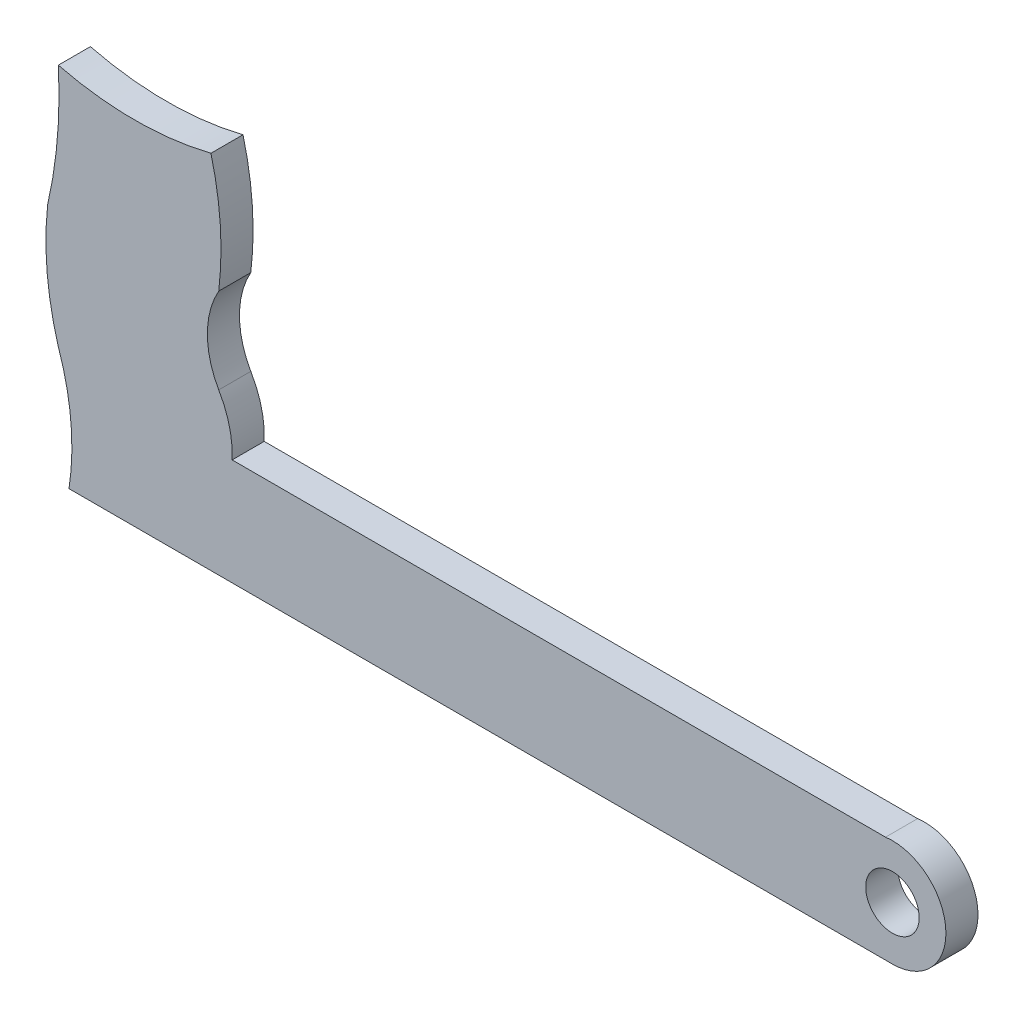
ISO-10303-21;
HEADER;
FILE_DESCRIPTION(('STEP AP214'),'2;1');
FILE_NAME('part.step','',(''),(''),'','','');
FILE_SCHEMA(('AUTOMOTIVE_DESIGN { 1 0 10303 214 1 1 1 1 }'));
ENDSEC;
DATA;
#1=APPLICATION_CONTEXT('core data for automotive mechanical design processes');
#2=APPLICATION_PROTOCOL_DEFINITION('international standard','automotive_design',2000,#1);
#3=PRODUCT_CONTEXT('',#1,'mechanical');
#4=PRODUCT('Part','Part','',(#3));
#5=PRODUCT_RELATED_PRODUCT_CATEGORY('part','',(#4));
#6=PRODUCT_DEFINITION_FORMATION('','',#4);
#7=PRODUCT_DEFINITION_CONTEXT('part definition',#1,'design');
#8=PRODUCT_DEFINITION('design','',#6,#7);
#9=PRODUCT_DEFINITION_SHAPE('','',#8);
#10=(LENGTH_UNIT() NAMED_UNIT(*) SI_UNIT(.MILLI.,.METRE.));
#11=(NAMED_UNIT(*) PLANE_ANGLE_UNIT() SI_UNIT($,.RADIAN.));
#12=(NAMED_UNIT(*) SI_UNIT($,.STERADIAN.) SOLID_ANGLE_UNIT());
#13=UNCERTAINTY_MEASURE_WITH_UNIT(LENGTH_MEASURE(1.E-05),#10,'distance_accuracy_value','');
#14=(GEOMETRIC_REPRESENTATION_CONTEXT(3) GLOBAL_UNCERTAINTY_ASSIGNED_CONTEXT((#13)) GLOBAL_UNIT_ASSIGNED_CONTEXT((#10,
#11,#12)) REPRESENTATION_CONTEXT('',''));
#15=CARTESIAN_POINT('',(0.,0.,0.));
#16=DIRECTION('',(0.,0.,1.));
#17=DIRECTION('',(1.,0.,0.));
#18=AXIS2_PLACEMENT_3D('',#15,#16,#17);
#19=CARTESIAN_POINT('',(88.0801207921958,17.0999907406828,3.));
#20=DIRECTION('',(0.,0.,1.));
#21=DIRECTION('',(1.,0.,0.));
#22=AXIS2_PLACEMENT_3D('',#19,#20,#21);
#23=PLANE('',#22);
#24=CARTESIAN_POINT('',(88.0801207921958,17.0999907406828,3.));
#25=DIRECTION('',(0.,0.,1.));
#26=DIRECTION('',(1.,0.,0.));
#27=AXIS2_PLACEMENT_3D('',#24,#25,#26);
#28=CIRCLE('',#27,5.);
#29=CARTESIAN_POINT('',(88.0801194341853,12.099990740683,3.));
#30=VERTEX_POINT('',#29);
#31=CARTESIAN_POINT('',(87.4334993703278,22.0580025132366,3.));
#32=VERTEX_POINT('',#31);
#33=EDGE_CURVE('E171',#30,#32,#28,.T.);
#34=ORIENTED_EDGE('',*,*,#33,.T.);
#35=DIRECTION('',(-0.999999999999852,5.4384135059956E-07,0.));
#36=VECTOR('',#35,1.);
#37=CARTESIAN_POINT('',(87.4334993703278,22.0580025132366,3.));
#38=LINE('',#37,#36);
#39=CARTESIAN_POINT('',(26.3348825764364,22.0580357411908,3.));
#40=VERTEX_POINT('',#39);
#41=EDGE_CURVE('E100',#32,#40,#38,.T.);
#42=ORIENTED_EDGE('',*,*,#41,.T.);
#43=CARTESIAN_POINT('',(17.298587041474,22.4863756925505,3.));
#44=DIRECTION('',(0.,0.,1.));
#45=DIRECTION('',(1.,0.,0.));
#46=AXIS2_PLACEMENT_3D('',#43,#44,#45);
#47=CIRCLE('',#46,9.04644195853332);
#48=CARTESIAN_POINT('',(25.0801262306187,27.1000250026864,3.));
#49=VERTEX_POINT('',#48);
#50=EDGE_CURVE('E195',#40,#49,#47,.T.);
#51=ORIENTED_EDGE('',*,*,#50,.T.);
#52=CARTESIAN_POINT('',(32.0801284059827,31.1000211957963,3.));
#53=DIRECTION('',(0.,0.,-1.));
#54=DIRECTION('',(1.,0.,0.));
#55=AXIS2_PLACEMENT_3D('',#52,#53,#54);
#56=CIRCLE('',#55,8.06225774829823);
#57=CARTESIAN_POINT('',(25.0801305813495,35.1000250026852,3.));
#58=VERTEX_POINT('',#57);
#59=EDGE_CURVE('E212',#49,#58,#56,.T.);
#60=ORIENTED_EDGE('',*,*,#59,.T.);
#61=CARTESIAN_POINT('',(-3.41240796645049,38.6000404981064,3.));
#62=DIRECTION('',(0.,0.,1.));
#63=DIRECTION('',(1.,0.,0.));
#64=AXIS2_PLACEMENT_3D('',#61,#62,#63);
#65=CIRCLE('',#64,28.7067041188301);
#66=CARTESIAN_POINT('',(24.3506133811086,45.9000067323454,3.));
#67=VERTEX_POINT('',#66);
#68=EDGE_CURVE('E209',#58,#67,#65,.T.);
#69=ORIENTED_EDGE('',*,*,#68,.T.);
#70=CARTESIAN_POINT('',(17.2153820200913,74.4710341033217,3.));
#71=DIRECTION('',(0.,0.,-1.));
#72=DIRECTION('',(1.,0.,0.));
#73=AXIS2_PLACEMENT_3D('',#70,#71,#72);
#74=CIRCLE('',#73,29.448516628318);
#75=CARTESIAN_POINT('',(10.080135102766,45.9000106173295,3.));
#76=VERTEX_POINT('',#75);
#77=EDGE_CURVE('E211',#67,#76,#74,.T.);
#78=ORIENTED_EDGE('',*,*,#77,.T.);
#79=CARTESIAN_POINT('',(-31.719703530583,43.5000328470985,3.));
#80=DIRECTION('',(0.,0.,-1.));
#81=DIRECTION('',(1.,0.,0.));
#82=AXIS2_PLACEMENT_3D('',#79,#80,#81);
#83=CIRCLE('',#82,41.868680455343);
#84=CARTESIAN_POINT('',(9.08013003751042,34.1000337041467,3.));
#85=VERTEX_POINT('',#84);
#86=EDGE_CURVE('E214',#76,#85,#83,.T.);
#87=ORIENTED_EDGE('',*,*,#86,.T.);
#88=CARTESIAN_POINT('',(37.0801284059796,31.1000184765895,3.));
#89=DIRECTION('',(0.,0.,1.));
#90=DIRECTION('',(1.,0.,0.));
#91=AXIS2_PLACEMENT_3D('',#88,#89,#90);
#92=CIRCLE('',#91,28.1602556806548);
#93=CARTESIAN_POINT('',(10.0801240552555,23.1000331603073,3.));
#94=VERTEX_POINT('',#93);
#95=EDGE_CURVE('E129',#85,#94,#92,.T.);
#96=ORIENTED_EDGE('',*,*,#95,.T.);
#97=CARTESIAN_POINT('',(-11.4198800235508,15.6000448528974,3.));
#98=DIRECTION('',(0.,0.,-1.));
#99=DIRECTION('',(1.,0.,0.));
#100=AXIS2_PLACEMENT_3D('',#97,#98,#99);
#101=CIRCLE('',#100,22.7705950734708);
#102=CARTESIAN_POINT('',(11.0801180730005,12.1000326164675,3.));
#103=VERTEX_POINT('',#102);
#104=EDGE_CURVE('E122',#94,#103,#101,.T.);
#105=ORIENTED_EDGE('',*,*,#104,.T.);
#106=DIRECTION('',(0.999999999999226,-1.24450502052181E-06,0.));
#107=VECTOR('',#106,1.);
#108=CARTESIAN_POINT('',(11.0801180730005,12.1000326164675,3.));
#109=LINE('',#108,#107);
#110=CARTESIAN_POINT('',(32.6262172105486,12.100005802239,3.));
#111=VERTEX_POINT('',#110);
#112=EDGE_CURVE('E126',#103,#111,#109,.T.);
#113=ORIENTED_EDGE('',*,*,#112,.T.);
#114=DIRECTION('',(0.999999999999963,-2.71606035371371E-07,0.));
#115=VECTOR('',#114,1.);
#116=CARTESIAN_POINT('',(32.6262172105486,12.100005802239,3.));
#117=LINE('',#116,#115);
#118=EDGE_CURVE('E50',#111,#30,#117,.T.);
#119=ORIENTED_EDGE('',*,*,#118,.T.);
#120=EDGE_LOOP('',(#34,#42,#51,#60,#69,#78,#87,#96,#105,#113,#119));
#121=FACE_BOUND('',#120,.T.);
#122=CARTESIAN_POINT('',(88.0801207921958,17.0999907406828,3.));
#123=DIRECTION('',(0.,0.,1.));
#124=DIRECTION('',(1.,0.,0.));
#125=AXIS2_PLACEMENT_3D('',#122,#123,#124);
#126=CIRCLE('',#125,2.5);
#127=CARTESIAN_POINT('',(90.5801207921958,17.0999907406828,3.));
#128=VERTEX_POINT('',#127);
#129=EDGE_CURVE('E153',#128,#128,#126,.T.);
#130=ORIENTED_EDGE('',*,*,#129,.F.);
#131=EDGE_LOOP('',(#130));
#132=FACE_BOUND('',#131,.T.);
#133=ADVANCED_FACE('F33',(#121,#132),#23,.T.);
#134=CARTESIAN_POINT('',(88.0801207921958,17.0999907406828,0.));
#135=DIRECTION('',(0.,0.,1.));
#136=DIRECTION('',(1.,0.,0.));
#137=AXIS2_PLACEMENT_3D('',#134,#135,#136);
#138=PLANE('',#137);
#139=CARTESIAN_POINT('',(88.0801207921958,17.0999907406828,0.));
#140=DIRECTION('',(0.,0.,1.));
#141=DIRECTION('',(1.,0.,0.));
#142=AXIS2_PLACEMENT_3D('',#139,#140,#141);
#143=CIRCLE('',#142,5.);
#144=CARTESIAN_POINT('',(88.0801194341853,12.099990740683,0.));
#145=VERTEX_POINT('',#144);
#146=CARTESIAN_POINT('',(87.4334993703278,22.0580025132366,0.));
#147=VERTEX_POINT('',#146);
#148=EDGE_CURVE('E149',#145,#147,#143,.T.);
#149=ORIENTED_EDGE('',*,*,#148,.F.);
#150=DIRECTION('',(0.999999999999963,-2.71604312357221E-07,0.));
#151=VECTOR('',#150,1.);
#152=CARTESIAN_POINT('',(54.087474294767,12.099999973232,0.));
#153=LINE('',#152,#151);
#154=CARTESIAN_POINT('',(32.6262172105486,12.100005802239,0.));
#155=VERTEX_POINT('',#154);
#156=EDGE_CURVE('E88',#155,#145,#153,.T.);
#157=ORIENTED_EDGE('',*,*,#156,.F.);
#158=DIRECTION('',(0.999999999999226,-1.24450502052181E-06,0.));
#159=VECTOR('',#158,1.);
#160=CARTESIAN_POINT('',(11.0801180730005,12.1000326164675,0.));
#161=LINE('',#160,#159);
#162=CARTESIAN_POINT('',(11.0801180730005,12.1000326164675,0.));
#163=VERTEX_POINT('',#162);
#164=EDGE_CURVE('E168',#163,#155,#161,.T.);
#165=ORIENTED_EDGE('',*,*,#164,.F.);
#166=CARTESIAN_POINT('',(-11.4198800235508,15.6000448528974,0.));
#167=DIRECTION('',(0.,0.,-1.));
#168=DIRECTION('',(1.,0.,0.));
#169=AXIS2_PLACEMENT_3D('',#166,#167,#168);
#170=CIRCLE('',#169,22.7705950734708);
#171=CARTESIAN_POINT('',(10.0801240552555,23.1000331603073,0.));
#172=VERTEX_POINT('',#171);
#173=EDGE_CURVE('E138',#172,#163,#170,.T.);
#174=ORIENTED_EDGE('',*,*,#173,.F.);
#175=CARTESIAN_POINT('',(37.0801284059796,31.1000184765895,0.));
#176=DIRECTION('',(0.,0.,1.));
#177=DIRECTION('',(1.,0.,0.));
#178=AXIS2_PLACEMENT_3D('',#175,#176,#177);
#179=CIRCLE('',#178,28.1602556806548);
#180=CARTESIAN_POINT('',(9.08013003751042,34.1000337041467,0.));
#181=VERTEX_POINT('',#180);
#182=EDGE_CURVE('E165',#181,#172,#179,.T.);
#183=ORIENTED_EDGE('',*,*,#182,.F.);
#184=CARTESIAN_POINT('',(-31.719703530583,43.5000328470985,0.));
#185=DIRECTION('',(0.,0.,-1.));
#186=DIRECTION('',(1.,0.,0.));
#187=AXIS2_PLACEMENT_3D('',#184,#185,#186);
#188=CIRCLE('',#187,41.868680455343);
#189=CARTESIAN_POINT('',(10.080135102766,45.9000106173295,0.));
#190=VERTEX_POINT('',#189);
#191=EDGE_CURVE('E163',#190,#181,#188,.T.);
#192=ORIENTED_EDGE('',*,*,#191,.F.);
#193=CARTESIAN_POINT('',(17.2153820200913,74.4710341033217,0.));
#194=DIRECTION('',(0.,0.,-1.));
#195=DIRECTION('',(1.,0.,0.));
#196=AXIS2_PLACEMENT_3D('',#193,#194,#195);
#197=CIRCLE('',#196,29.448516628318);
#198=CARTESIAN_POINT('',(24.3506133811086,45.9000067323454,0.));
#199=VERTEX_POINT('',#198);
#200=EDGE_CURVE('E161',#199,#190,#197,.T.);
#201=ORIENTED_EDGE('',*,*,#200,.F.);
#202=CARTESIAN_POINT('',(-3.41240796645049,38.6000404981064,0.));
#203=DIRECTION('',(0.,0.,1.));
#204=DIRECTION('',(1.,0.,0.));
#205=AXIS2_PLACEMENT_3D('',#202,#203,#204);
#206=CIRCLE('',#205,28.7067041188301);
#207=CARTESIAN_POINT('',(25.0801305813495,35.1000250026852,0.));
#208=VERTEX_POINT('',#207);
#209=EDGE_CURVE('E159',#208,#199,#206,.T.);
#210=ORIENTED_EDGE('',*,*,#209,.F.);
#211=CARTESIAN_POINT('',(32.0801284059827,31.1000211957963,0.));
#212=DIRECTION('',(0.,0.,-1.));
#213=DIRECTION('',(1.,0.,0.));
#214=AXIS2_PLACEMENT_3D('',#211,#212,#213);
#215=CIRCLE('',#214,8.06225774829823);
#216=CARTESIAN_POINT('',(25.0801262306187,27.1000250026864,0.));
#217=VERTEX_POINT('',#216);
#218=EDGE_CURVE('E157',#217,#208,#215,.T.);
#219=ORIENTED_EDGE('',*,*,#218,.F.);
#220=CARTESIAN_POINT('',(17.298587041474,22.4863756925505,0.));
#221=DIRECTION('',(0.,0.,1.));
#222=DIRECTION('',(1.,0.,0.));
#223=AXIS2_PLACEMENT_3D('',#220,#221,#222);
#224=CIRCLE('',#223,9.04644195853332);
#225=CARTESIAN_POINT('',(26.3348825764364,22.0580357411908,0.));
#226=VERTEX_POINT('',#225);
#227=EDGE_CURVE('E155',#226,#217,#224,.T.);
#228=ORIENTED_EDGE('',*,*,#227,.F.);
#229=DIRECTION('',(-0.999999999999852,5.4384135059956E-07,0.));
#230=VECTOR('',#229,1.);
#231=CARTESIAN_POINT('',(87.4334993703278,22.0580025132366,0.));
#232=LINE('',#231,#230);
#233=EDGE_CURVE('E152',#147,#226,#232,.T.);
#234=ORIENTED_EDGE('',*,*,#233,.F.);
#235=EDGE_LOOP('',(#149,#157,#165,#174,#183,#192,#201,#210,#219,#228,#234));
#236=FACE_BOUND('',#235,.T.);
#237=CARTESIAN_POINT('',(88.0801207921958,17.0999907406828,0.));
#238=DIRECTION('',(0.,0.,1.));
#239=DIRECTION('',(1.,0.,0.));
#240=AXIS2_PLACEMENT_3D('',#237,#238,#239);
#241=CIRCLE('',#240,2.5);
#242=CARTESIAN_POINT('',(90.5801207921958,17.0999907406828,0.));
#243=VERTEX_POINT('',#242);
#244=EDGE_CURVE('E235',#243,#243,#241,.T.);
#245=ORIENTED_EDGE('',*,*,#244,.T.);
#246=EDGE_LOOP('',(#245));
#247=FACE_BOUND('',#246,.T.);
#248=ADVANCED_FACE('F197',(#236,#247),#138,.F.);
#249=CARTESIAN_POINT('',(88.0801207921958,17.0999907406828,3.));
#250=DIRECTION('',(0.,0.,-1.));
#251=DIRECTION('',(-1.,0.,0.));
#252=AXIS2_PLACEMENT_3D('',#249,#250,#251);
#253=CYLINDRICAL_SURFACE('',#252,5.);
#254=ORIENTED_EDGE('',*,*,#148,.T.);
#255=DIRECTION('',(0.,0.,-1.));
#256=VECTOR('',#255,1.);
#257=CARTESIAN_POINT('',(87.4334993703278,22.0580025132366,3.));
#258=LINE('',#257,#256);
#259=EDGE_CURVE('E11',#32,#147,#258,.T.);
#260=ORIENTED_EDGE('',*,*,#259,.F.);
#261=ORIENTED_EDGE('',*,*,#33,.F.);
#262=DIRECTION('',(0.,0.,-1.));
#263=VECTOR('',#262,1.);
#264=CARTESIAN_POINT('',(88.0801194341853,12.099990740683,3.));
#265=LINE('',#264,#263);
#266=EDGE_CURVE('E145',#30,#145,#265,.T.);
#267=ORIENTED_EDGE('',*,*,#266,.T.);
#268=EDGE_LOOP('',(#254,#260,#261,#267));
#269=FACE_BOUND('',#268,.T.);
#270=ADVANCED_FACE('F35',(#269),#253,.T.);
#271=CARTESIAN_POINT('',(87.4334993703278,22.0580025132366,3.));
#272=DIRECTION('',(-5.4384135059956E-07,-0.999999999999852,0.));
#273=DIRECTION('',(0.999999999999852,-5.4384135059956E-07,0.));
#274=AXIS2_PLACEMENT_3D('',#271,#272,#273);
#275=PLANE('',#274);
#276=ORIENTED_EDGE('',*,*,#233,.T.);
#277=DIRECTION('',(0.,0.,-1.));
#278=VECTOR('',#277,1.);
#279=CARTESIAN_POINT('',(26.3348825764364,22.0580357411908,3.));
#280=LINE('',#279,#278);
#281=EDGE_CURVE('E42',#40,#226,#280,.T.);
#282=ORIENTED_EDGE('',*,*,#281,.F.);
#283=ORIENTED_EDGE('',*,*,#41,.F.);
#284=ORIENTED_EDGE('',*,*,#259,.T.);
#285=EDGE_LOOP('',(#276,#282,#283,#284));
#286=FACE_BOUND('',#285,.T.);
#287=ADVANCED_FACE('F270',(#286),#275,.F.);
#288=CARTESIAN_POINT('',(17.298587041474,22.4863756925505,3.));
#289=DIRECTION('',(0.,0.,-1.));
#290=DIRECTION('',(-1.,0.,0.));
#291=AXIS2_PLACEMENT_3D('',#288,#289,#290);
#292=CYLINDRICAL_SURFACE('',#291,9.04644195853332);
#293=ORIENTED_EDGE('',*,*,#227,.T.);
#294=DIRECTION('',(0.,0.,-1.));
#295=VECTOR('',#294,1.);
#296=CARTESIAN_POINT('',(25.0801262306187,27.1000250026864,3.));
#297=LINE('',#296,#295);
#298=EDGE_CURVE('E187',#49,#217,#297,.T.);
#299=ORIENTED_EDGE('',*,*,#298,.F.);
#300=ORIENTED_EDGE('',*,*,#50,.F.);
#301=ORIENTED_EDGE('',*,*,#281,.T.);
#302=EDGE_LOOP('',(#293,#299,#300,#301));
#303=FACE_BOUND('',#302,.T.);
#304=ADVANCED_FACE('F193',(#303),#292,.T.);
#305=CARTESIAN_POINT('',(32.0801284059827,31.1000211957963,3.));
#306=DIRECTION('',(0.,0.,-1.));
#307=DIRECTION('',(-1.,0.,0.));
#308=AXIS2_PLACEMENT_3D('',#305,#306,#307);
#309=CYLINDRICAL_SURFACE('',#308,8.06225774829823);
#310=ORIENTED_EDGE('',*,*,#218,.T.);
#311=DIRECTION('',(0.,0.,-1.));
#312=VECTOR('',#311,1.);
#313=CARTESIAN_POINT('',(25.0801305813495,35.1000250026852,3.));
#314=LINE('',#313,#312);
#315=EDGE_CURVE('E184',#58,#208,#314,.T.);
#316=ORIENTED_EDGE('',*,*,#315,.F.);
#317=ORIENTED_EDGE('',*,*,#59,.F.);
#318=ORIENTED_EDGE('',*,*,#298,.T.);
#319=EDGE_LOOP('',(#310,#316,#317,#318));
#320=FACE_BOUND('',#319,.T.);
#321=ADVANCED_FACE('F203',(#320),#309,.F.);
#322=CARTESIAN_POINT('',(-3.41240796645049,38.6000404981064,3.));
#323=DIRECTION('',(0.,0.,-1.));
#324=DIRECTION('',(-1.,0.,0.));
#325=AXIS2_PLACEMENT_3D('',#322,#323,#324);
#326=CYLINDRICAL_SURFACE('',#325,28.7067041188301);
#327=ORIENTED_EDGE('',*,*,#209,.T.);
#328=DIRECTION('',(0.,0.,-1.));
#329=VECTOR('',#328,1.);
#330=CARTESIAN_POINT('',(24.3506133811086,45.9000067323454,3.));
#331=LINE('',#330,#329);
#332=EDGE_CURVE('E181',#67,#199,#331,.T.);
#333=ORIENTED_EDGE('',*,*,#332,.F.);
#334=ORIENTED_EDGE('',*,*,#68,.F.);
#335=ORIENTED_EDGE('',*,*,#315,.T.);
#336=EDGE_LOOP('',(#327,#333,#334,#335));
#337=FACE_BOUND('',#336,.T.);
#338=ADVANCED_FACE('F207',(#337),#326,.T.);
#339=CARTESIAN_POINT('',(17.2153820200913,74.4710341033217,3.));
#340=DIRECTION('',(0.,0.,-1.));
#341=DIRECTION('',(-1.,0.,0.));
#342=AXIS2_PLACEMENT_3D('',#339,#340,#341);
#343=CYLINDRICAL_SURFACE('',#342,29.448516628318);
#344=ORIENTED_EDGE('',*,*,#200,.T.);
#345=DIRECTION('',(0.,0.,-1.));
#346=VECTOR('',#345,1.);
#347=CARTESIAN_POINT('',(10.080135102766,45.9000106173295,3.));
#348=LINE('',#347,#346);
#349=EDGE_CURVE('E178',#76,#190,#348,.T.);
#350=ORIENTED_EDGE('',*,*,#349,.F.);
#351=ORIENTED_EDGE('',*,*,#77,.F.);
#352=ORIENTED_EDGE('',*,*,#332,.T.);
#353=EDGE_LOOP('',(#344,#350,#351,#352));
#354=FACE_BOUND('',#353,.T.);
#355=ADVANCED_FACE('F261',(#354),#343,.F.);
#356=CARTESIAN_POINT('',(-31.719703530583,43.5000328470985,3.));
#357=DIRECTION('',(0.,0.,-1.));
#358=DIRECTION('',(-1.,0.,0.));
#359=AXIS2_PLACEMENT_3D('',#356,#357,#358);
#360=CYLINDRICAL_SURFACE('',#359,41.868680455343);
#361=ORIENTED_EDGE('',*,*,#191,.T.);
#362=DIRECTION('',(0.,0.,-1.));
#363=VECTOR('',#362,1.);
#364=CARTESIAN_POINT('',(9.08013003751042,34.1000337041467,3.));
#365=LINE('',#364,#363);
#366=EDGE_CURVE('E175',#85,#181,#365,.T.);
#367=ORIENTED_EDGE('',*,*,#366,.F.);
#368=ORIENTED_EDGE('',*,*,#86,.F.);
#369=ORIENTED_EDGE('',*,*,#349,.T.);
#370=EDGE_LOOP('',(#361,#367,#368,#369));
#371=FACE_BOUND('',#370,.T.);
#372=ADVANCED_FACE('F223',(#371),#360,.F.);
#373=CARTESIAN_POINT('',(37.0801284059796,31.1000184765895,3.));
#374=DIRECTION('',(0.,0.,-1.));
#375=DIRECTION('',(-1.,0.,0.));
#376=AXIS2_PLACEMENT_3D('',#373,#374,#375);
#377=CYLINDRICAL_SURFACE('',#376,28.1602556806548);
#378=ORIENTED_EDGE('',*,*,#182,.T.);
#379=DIRECTION('',(0.,0.,-1.));
#380=VECTOR('',#379,1.);
#381=CARTESIAN_POINT('',(10.0801240552555,23.1000331603073,3.));
#382=LINE('',#381,#380);
#383=EDGE_CURVE('E140',#94,#172,#382,.T.);
#384=ORIENTED_EDGE('',*,*,#383,.F.);
#385=ORIENTED_EDGE('',*,*,#95,.F.);
#386=ORIENTED_EDGE('',*,*,#366,.T.);
#387=EDGE_LOOP('',(#378,#384,#385,#386));
#388=FACE_BOUND('',#387,.T.);
#389=ADVANCED_FACE('F227',(#388),#377,.T.);
#390=CARTESIAN_POINT('',(-11.4198800235508,15.6000448528974,3.));
#391=DIRECTION('',(0.,0.,-1.));
#392=DIRECTION('',(-1.,0.,0.));
#393=AXIS2_PLACEMENT_3D('',#390,#391,#392);
#394=CYLINDRICAL_SURFACE('',#393,22.7705950734708);
#395=ORIENTED_EDGE('',*,*,#173,.T.);
#396=DIRECTION('',(0.,0.,-1.));
#397=VECTOR('',#396,1.);
#398=CARTESIAN_POINT('',(11.0801180730005,12.1000326164675,3.));
#399=LINE('',#398,#397);
#400=EDGE_CURVE('E135',#103,#163,#399,.T.);
#401=ORIENTED_EDGE('',*,*,#400,.F.);
#402=ORIENTED_EDGE('',*,*,#104,.F.);
#403=ORIENTED_EDGE('',*,*,#383,.T.);
#404=EDGE_LOOP('',(#395,#401,#402,#403));
#405=FACE_BOUND('',#404,.T.);
#406=ADVANCED_FACE('F136',(#405),#394,.F.);
#407=CARTESIAN_POINT('',(11.0801180730005,12.1000326164675,3.));
#408=DIRECTION('',(1.24450502052181E-06,0.999999999999226,0.));
#409=DIRECTION('',(-0.999999999999226,1.24450502052181E-06,0.));
#410=AXIS2_PLACEMENT_3D('',#407,#408,#409);
#411=PLANE('',#410);
#412=ORIENTED_EDGE('',*,*,#164,.T.);
#413=DIRECTION('',(0.,0.,-1.));
#414=VECTOR('',#413,1.);
#415=CARTESIAN_POINT('',(32.6262172105486,12.100005802239,3.));
#416=LINE('',#415,#414);
#417=EDGE_CURVE('E141',#111,#155,#416,.T.);
#418=ORIENTED_EDGE('',*,*,#417,.F.);
#419=ORIENTED_EDGE('',*,*,#112,.F.);
#420=ORIENTED_EDGE('',*,*,#400,.T.);
#421=EDGE_LOOP('',(#412,#418,#419,#420));
#422=FACE_BOUND('',#421,.T.);
#423=ADVANCED_FACE('F143',(#422),#411,.F.);
#424=CARTESIAN_POINT('',(54.087474294767,12.099999973232,3.));
#425=DIRECTION('',(2.71604312357221E-07,0.999999999999963,0.));
#426=DIRECTION('',(-0.999999999999963,2.71604312357221E-07,0.));
#427=AXIS2_PLACEMENT_3D('',#424,#425,#426);
#428=PLANE('',#427);
#429=ORIENTED_EDGE('',*,*,#156,.T.);
#430=ORIENTED_EDGE('',*,*,#266,.F.);
#431=ORIENTED_EDGE('',*,*,#118,.F.);
#432=ORIENTED_EDGE('',*,*,#417,.T.);
#433=EDGE_LOOP('',(#429,#430,#431,#432));
#434=FACE_BOUND('',#433,.T.);
#435=ADVANCED_FACE('F228',(#434),#428,.F.);
#436=CARTESIAN_POINT('',(88.0801207921958,17.0999907406828,3.));
#437=DIRECTION('',(0.,0.,-1.));
#438=DIRECTION('',(-1.,0.,0.));
#439=AXIS2_PLACEMENT_3D('',#436,#437,#438);
#440=CYLINDRICAL_SURFACE('',#439,2.5);
#441=ORIENTED_EDGE('',*,*,#129,.T.);
#442=EDGE_LOOP('',(#441));
#443=FACE_BOUND('',#442,.T.);
#444=ORIENTED_EDGE('',*,*,#244,.F.);
#445=EDGE_LOOP('',(#444));
#446=FACE_BOUND('',#445,.T.);
#447=ADVANCED_FACE('F241',(#443,#446),#440,.F.);
#448=CLOSED_SHELL('',(#133,#248,#270,#287,#304,#321,#338,#355,#372,#389,#406,#423,#435,#447));
#449=MANIFOLD_SOLID_BREP('B2',#448);
#450=ADVANCED_BREP_SHAPE_REPRESENTATION('',(#18,#449),#14);
#451=SHAPE_DEFINITION_REPRESENTATION(#9,#450);
ENDSEC;
END-ISO-10303-21;
